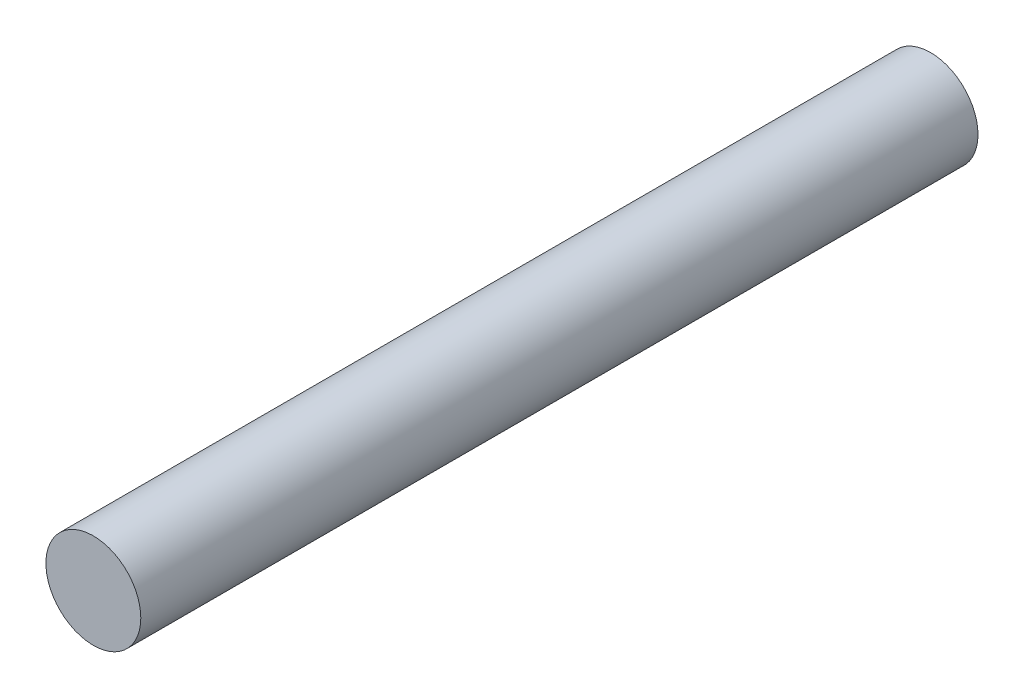
ISO-10303-21;
HEADER;
FILE_DESCRIPTION(('STEP AP214'),'2;1');
FILE_NAME('part.step','',(''),(''),'','','');
FILE_SCHEMA(('AUTOMOTIVE_DESIGN { 1 0 10303 214 1 1 1 1 }'));
ENDSEC;
DATA;
#1=APPLICATION_CONTEXT('core data for automotive mechanical design processes');
#2=APPLICATION_PROTOCOL_DEFINITION('international standard','automotive_design',2000,#1);
#3=PRODUCT_CONTEXT('',#1,'mechanical');
#4=PRODUCT('Part','Part','',(#3));
#5=PRODUCT_RELATED_PRODUCT_CATEGORY('part','',(#4));
#6=PRODUCT_DEFINITION_FORMATION('','',#4);
#7=PRODUCT_DEFINITION_CONTEXT('part definition',#1,'design');
#8=PRODUCT_DEFINITION('design','',#6,#7);
#9=PRODUCT_DEFINITION_SHAPE('','',#8);
#10=(LENGTH_UNIT() NAMED_UNIT(*) SI_UNIT(.MILLI.,.METRE.));
#11=(NAMED_UNIT(*) PLANE_ANGLE_UNIT() SI_UNIT($,.RADIAN.));
#12=(NAMED_UNIT(*) SI_UNIT($,.STERADIAN.) SOLID_ANGLE_UNIT());
#13=UNCERTAINTY_MEASURE_WITH_UNIT(LENGTH_MEASURE(1.E-05),#10,'distance_accuracy_value','');
#14=(GEOMETRIC_REPRESENTATION_CONTEXT(3) GLOBAL_UNCERTAINTY_ASSIGNED_CONTEXT((#13)) GLOBAL_UNIT_ASSIGNED_CONTEXT((#10,
#11,#12)) REPRESENTATION_CONTEXT('',''));
#15=CARTESIAN_POINT('',(0.,0.,0.));
#16=DIRECTION('',(0.,0.,1.));
#17=DIRECTION('',(1.,0.,0.));
#18=AXIS2_PLACEMENT_3D('',#15,#16,#17);
#19=CARTESIAN_POINT('',(0.,0.,75.));
#20=DIRECTION('',(0.,0.,-1.));
#21=DIRECTION('',(-1.,0.,0.));
#22=AXIS2_PLACEMENT_3D('',#19,#20,#21);
#23=CYLINDRICAL_SURFACE('',#22,4.25);
#24=CARTESIAN_POINT('',(0.,0.,75.));
#25=DIRECTION('',(0.,0.,1.));
#26=DIRECTION('',(1.,0.,0.));
#27=AXIS2_PLACEMENT_3D('',#24,#25,#26);
#28=CIRCLE('',#27,4.25);
#29=CARTESIAN_POINT('',(4.25,0.,75.));
#30=VERTEX_POINT('',#29);
#31=EDGE_CURVE('E10',#30,#30,#28,.T.);
#32=ORIENTED_EDGE('',*,*,#31,.F.);
#33=EDGE_LOOP('',(#32));
#34=FACE_BOUND('',#33,.T.);
#35=CARTESIAN_POINT('',(0.,0.,0.));
#36=DIRECTION('',(0.,0.,1.));
#37=DIRECTION('',(1.,0.,0.));
#38=AXIS2_PLACEMENT_3D('',#35,#36,#37);
#39=CIRCLE('',#38,4.25);
#40=CARTESIAN_POINT('',(4.25,0.,0.));
#41=VERTEX_POINT('',#40);
#42=EDGE_CURVE('E34',#41,#41,#39,.T.);
#43=ORIENTED_EDGE('',*,*,#42,.T.);
#44=EDGE_LOOP('',(#43));
#45=FACE_BOUND('',#44,.T.);
#46=ADVANCED_FACE('F31',(#34,#45),#23,.T.);
#47=CARTESIAN_POINT('',(0.,0.,75.));
#48=DIRECTION('',(0.,0.,1.));
#49=DIRECTION('',(1.,0.,0.));
#50=AXIS2_PLACEMENT_3D('',#47,#48,#49);
#51=PLANE('',#50);
#52=ORIENTED_EDGE('',*,*,#31,.T.);
#53=EDGE_LOOP('',(#52));
#54=FACE_BOUND('',#53,.T.);
#55=ADVANCED_FACE('F46',(#54),#51,.T.);
#56=CARTESIAN_POINT('',(0.,0.,0.));
#57=DIRECTION('',(0.,0.,1.));
#58=DIRECTION('',(1.,0.,0.));
#59=AXIS2_PLACEMENT_3D('',#56,#57,#58);
#60=PLANE('',#59);
#61=ORIENTED_EDGE('',*,*,#42,.F.);
#62=EDGE_LOOP('',(#61));
#63=FACE_BOUND('',#62,.T.);
#64=ADVANCED_FACE('F44',(#63),#60,.F.);
#65=CLOSED_SHELL('',(#46,#55,#64));
#66=MANIFOLD_SOLID_BREP('B2',#65);
#67=ADVANCED_BREP_SHAPE_REPRESENTATION('',(#18,#66),#14);
#68=SHAPE_DEFINITION_REPRESENTATION(#9,#67);
ENDSEC;
END-ISO-10303-21;
